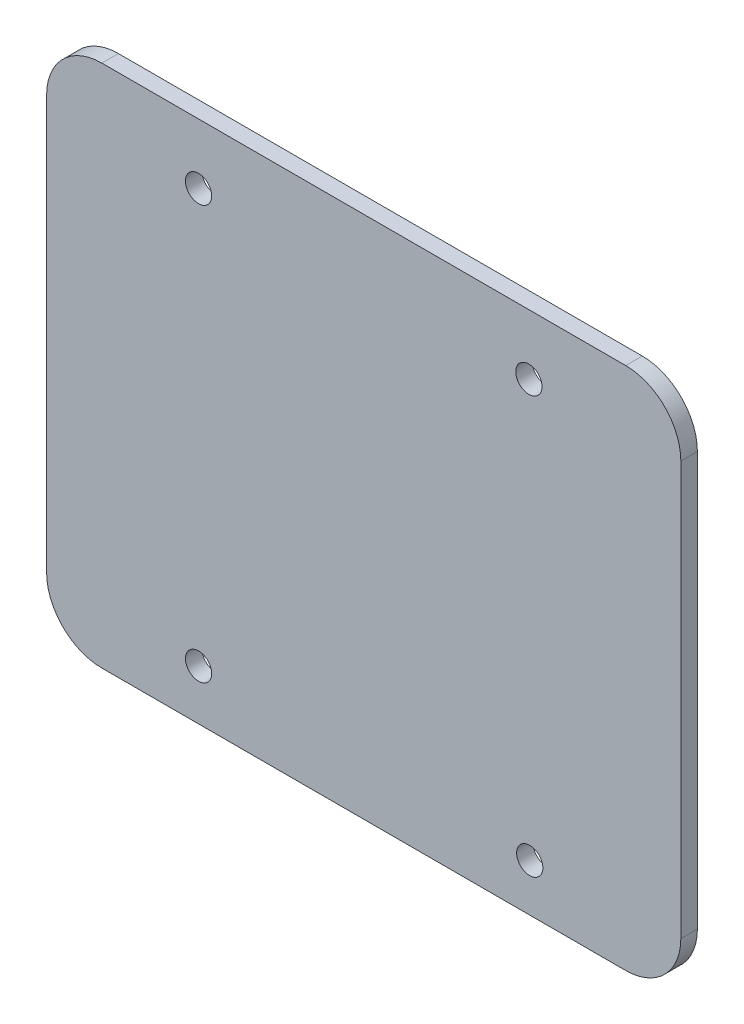
ISO-10303-21;
HEADER;
FILE_DESCRIPTION(('STEP AP214'),'2;1');
FILE_NAME('part.step','',(''),(''),'','','');
FILE_SCHEMA(('AUTOMOTIVE_DESIGN { 1 0 10303 214 1 1 1 1 }'));
ENDSEC;
DATA;
#1=APPLICATION_CONTEXT('core data for automotive mechanical design processes');
#2=APPLICATION_PROTOCOL_DEFINITION('international standard','automotive_design',2000,#1);
#3=PRODUCT_CONTEXT('',#1,'mechanical');
#4=PRODUCT('Part','Part','',(#3));
#5=PRODUCT_RELATED_PRODUCT_CATEGORY('part','',(#4));
#6=PRODUCT_DEFINITION_FORMATION('','',#4);
#7=PRODUCT_DEFINITION_CONTEXT('part definition',#1,'design');
#8=PRODUCT_DEFINITION('design','',#6,#7);
#9=PRODUCT_DEFINITION_SHAPE('','',#8);
#10=(LENGTH_UNIT() NAMED_UNIT(*) SI_UNIT(.MILLI.,.METRE.));
#11=(NAMED_UNIT(*) PLANE_ANGLE_UNIT() SI_UNIT($,.RADIAN.));
#12=(NAMED_UNIT(*) SI_UNIT($,.STERADIAN.) SOLID_ANGLE_UNIT());
#13=UNCERTAINTY_MEASURE_WITH_UNIT(LENGTH_MEASURE(1.E-05),#10,'distance_accuracy_value','');
#14=(GEOMETRIC_REPRESENTATION_CONTEXT(3) GLOBAL_UNCERTAINTY_ASSIGNED_CONTEXT((#13)) GLOBAL_UNIT_ASSIGNED_CONTEXT((#10,
#11,#12)) REPRESENTATION_CONTEXT('',''));
#15=CARTESIAN_POINT('',(0.,0.,0.));
#16=DIRECTION('',(0.,0.,1.));
#17=DIRECTION('',(1.,0.,0.));
#18=AXIS2_PLACEMENT_3D('',#15,#16,#17);
#19=CARTESIAN_POINT('',(10.,10.,3.));
#20=DIRECTION('',(0.,0.,-1.));
#21=DIRECTION('',(-1.,0.,0.));
#22=AXIS2_PLACEMENT_3D('',#19,#20,#21);
#23=PLANE('',#22);
#24=CARTESIAN_POINT('',(10.,10.,3.));
#25=DIRECTION('',(0.,0.,1.));
#26=DIRECTION('',(-1.,0.,0.));
#27=AXIS2_PLACEMENT_3D('',#24,#25,#26);
#28=CIRCLE('',#27,10.);
#29=CARTESIAN_POINT('',(0.,10.0000000000001,3.));
#30=VERTEX_POINT('',#29);
#31=CARTESIAN_POINT('',(10.0000000000001,0.,3.));
#32=VERTEX_POINT('',#31);
#33=EDGE_CURVE('E146',#30,#32,#28,.T.);
#34=ORIENTED_EDGE('',*,*,#33,.T.);
#35=DIRECTION('',(1.,0.,0.));
#36=VECTOR('',#35,1.);
#37=CARTESIAN_POINT('',(10.0000000000001,0.,3.));
#38=LINE('',#37,#36);
#39=CARTESIAN_POINT('',(105.,0.,3.));
#40=VERTEX_POINT('',#39);
#41=EDGE_CURVE('E94',#32,#40,#38,.T.);
#42=ORIENTED_EDGE('',*,*,#41,.T.);
#43=CARTESIAN_POINT('',(105.,10.,3.));
#44=DIRECTION('',(0.,0.,1.));
#45=DIRECTION('',(1.,0.,0.));
#46=AXIS2_PLACEMENT_3D('',#43,#44,#45);
#47=CIRCLE('',#46,10.);
#48=CARTESIAN_POINT('',(115.,10.,3.));
#49=VERTEX_POINT('',#48);
#50=EDGE_CURVE('E161',#40,#49,#47,.T.);
#51=ORIENTED_EDGE('',*,*,#50,.T.);
#52=DIRECTION('',(0.,1.,0.));
#53=VECTOR('',#52,1.);
#54=CARTESIAN_POINT('',(115.,10.0000000000001,3.));
#55=LINE('',#54,#53);
#56=CARTESIAN_POINT('',(115.,84.9999999999999,3.));
#57=VERTEX_POINT('',#56);
#58=EDGE_CURVE('E174',#49,#57,#55,.T.);
#59=ORIENTED_EDGE('',*,*,#58,.T.);
#60=CARTESIAN_POINT('',(105.,85.,3.));
#61=DIRECTION('',(0.,0.,1.));
#62=DIRECTION('',(-1.,0.,0.));
#63=AXIS2_PLACEMENT_3D('',#60,#61,#62);
#64=CIRCLE('',#63,9.99999999999999);
#65=CARTESIAN_POINT('',(105.,95.,3.));
#66=VERTEX_POINT('',#65);
#67=EDGE_CURVE('E113',#57,#66,#64,.T.);
#68=ORIENTED_EDGE('',*,*,#67,.T.);
#69=DIRECTION('',(-1.,0.,0.));
#70=VECTOR('',#69,1.);
#71=CARTESIAN_POINT('',(10.0000000000001,95.,3.));
#72=LINE('',#71,#70);
#73=CARTESIAN_POINT('',(10.0000000000001,95.,3.));
#74=VERTEX_POINT('',#73);
#75=EDGE_CURVE('E107',#66,#74,#72,.T.);
#76=ORIENTED_EDGE('',*,*,#75,.T.);
#77=CARTESIAN_POINT('',(10.,85.,3.));
#78=DIRECTION('',(0.,0.,1.));
#79=DIRECTION('',(-1.,0.,0.));
#80=AXIS2_PLACEMENT_3D('',#77,#78,#79);
#81=CIRCLE('',#80,10.);
#82=CARTESIAN_POINT('',(0.,84.9999999999999,3.));
#83=VERTEX_POINT('',#82);
#84=EDGE_CURVE('E111',#74,#83,#81,.T.);
#85=ORIENTED_EDGE('',*,*,#84,.T.);
#86=DIRECTION('',(0.,-1.,0.));
#87=VECTOR('',#86,1.);
#88=CARTESIAN_POINT('',(0.,10.0000000000001,3.));
#89=LINE('',#88,#87);
#90=EDGE_CURVE('E51',#83,#30,#89,.T.);
#91=ORIENTED_EDGE('',*,*,#90,.T.);
#92=EDGE_LOOP('',(#34,#42,#51,#59,#68,#76,#85,#91));
#93=FACE_BOUND('',#92,.T.);
#94=CARTESIAN_POINT('',(27.55,84.08,3.));
#95=DIRECTION('',(0.,0.,1.));
#96=DIRECTION('',(1.,0.,0.));
#97=AXIS2_PLACEMENT_3D('',#94,#95,#96);
#98=CIRCLE('',#97,2.38125);
#99=CARTESIAN_POINT('',(29.93125,84.08,3.));
#100=VERTEX_POINT('',#99);
#101=EDGE_CURVE('E135',#100,#100,#98,.T.);
#102=ORIENTED_EDGE('',*,*,#101,.F.);
#103=EDGE_LOOP('',(#102));
#104=FACE_BOUND('',#103,.T.);
#105=CARTESIAN_POINT('',(87.45,84.08,3.));
#106=DIRECTION('',(0.,0.,1.));
#107=DIRECTION('',(1.,0.,0.));
#108=AXIS2_PLACEMENT_3D('',#105,#106,#107);
#109=CIRCLE('',#108,2.38125);
#110=CARTESIAN_POINT('',(89.83125,84.08,3.));
#111=VERTEX_POINT('',#110);
#112=EDGE_CURVE('E183',#111,#111,#109,.T.);
#113=ORIENTED_EDGE('',*,*,#112,.F.);
#114=EDGE_LOOP('',(#113));
#115=FACE_BOUND('',#114,.T.);
#116=CARTESIAN_POINT('',(27.55,9.08000000000001,3.));
#117=DIRECTION('',(0.,0.,1.));
#118=DIRECTION('',(1.,0.,0.));
#119=AXIS2_PLACEMENT_3D('',#116,#117,#118);
#120=CIRCLE('',#119,2.38125);
#121=CARTESIAN_POINT('',(29.93125,9.08000000000001,3.));
#122=VERTEX_POINT('',#121);
#123=EDGE_CURVE('E189',#122,#122,#120,.T.);
#124=ORIENTED_EDGE('',*,*,#123,.F.);
#125=EDGE_LOOP('',(#124));
#126=FACE_BOUND('',#125,.T.);
#127=CARTESIAN_POINT('',(87.6,8.58014900676957,3.));
#128=DIRECTION('',(0.,0.,1.));
#129=DIRECTION('',(1.,0.,0.));
#130=AXIS2_PLACEMENT_3D('',#127,#128,#129);
#131=CIRCLE('',#130,2.38125000000001);
#132=CARTESIAN_POINT('',(89.98125,8.58014900676957,3.));
#133=VERTEX_POINT('',#132);
#134=EDGE_CURVE('E195',#133,#133,#131,.T.);
#135=ORIENTED_EDGE('',*,*,#134,.F.);
#136=EDGE_LOOP('',(#135));
#137=FACE_BOUND('',#136,.T.);
#138=ADVANCED_FACE('F34',(#93,#104,#115,#126,#137),#23,.F.);
#139=CARTESIAN_POINT('',(10.,10.,0.));
#140=DIRECTION('',(0.,0.,-1.));
#141=DIRECTION('',(-1.,0.,0.));
#142=AXIS2_PLACEMENT_3D('',#139,#140,#141);
#143=PLANE('',#142);
#144=CARTESIAN_POINT('',(27.55,9.08000000000001,0.));
#145=DIRECTION('',(0.,0.,1.));
#146=DIRECTION('',(1.,0.,0.));
#147=AXIS2_PLACEMENT_3D('',#144,#145,#146);
#148=CIRCLE('',#147,2.38125);
#149=CARTESIAN_POINT('',(29.93125,9.08000000000001,0.));
#150=VERTEX_POINT('',#149);
#151=EDGE_CURVE('E192',#150,#150,#148,.T.);
#152=ORIENTED_EDGE('',*,*,#151,.T.);
#153=EDGE_LOOP('',(#152));
#154=FACE_BOUND('',#153,.T.);
#155=CARTESIAN_POINT('',(27.55,84.08,0.));
#156=DIRECTION('',(0.,0.,1.));
#157=DIRECTION('',(1.,0.,0.));
#158=AXIS2_PLACEMENT_3D('',#155,#156,#157);
#159=CIRCLE('',#158,2.38125);
#160=CARTESIAN_POINT('',(29.93125,84.08,0.));
#161=VERTEX_POINT('',#160);
#162=EDGE_CURVE('E180',#161,#161,#159,.T.);
#163=ORIENTED_EDGE('',*,*,#162,.T.);
#164=EDGE_LOOP('',(#163));
#165=FACE_BOUND('',#164,.T.);
#166=CARTESIAN_POINT('',(10.,10.,0.));
#167=DIRECTION('',(0.,0.,1.));
#168=DIRECTION('',(-1.,0.,0.));
#169=AXIS2_PLACEMENT_3D('',#166,#167,#168);
#170=CIRCLE('',#169,10.);
#171=CARTESIAN_POINT('',(0.,10.0000000000001,0.));
#172=VERTEX_POINT('',#171);
#173=CARTESIAN_POINT('',(10.0000000000001,0.,0.));
#174=VERTEX_POINT('',#173);
#175=EDGE_CURVE('E131',#172,#174,#170,.T.);
#176=ORIENTED_EDGE('',*,*,#175,.F.);
#177=DIRECTION('',(0.,-1.,0.));
#178=VECTOR('',#177,1.);
#179=CARTESIAN_POINT('',(0.,10.0000000000001,0.));
#180=LINE('',#179,#178);
#181=CARTESIAN_POINT('',(0.,84.9999999999999,0.));
#182=VERTEX_POINT('',#181);
#183=EDGE_CURVE('E86',#182,#172,#180,.T.);
#184=ORIENTED_EDGE('',*,*,#183,.F.);
#185=CARTESIAN_POINT('',(10.,85.,0.));
#186=DIRECTION('',(0.,0.,1.));
#187=DIRECTION('',(-1.,0.,0.));
#188=AXIS2_PLACEMENT_3D('',#185,#186,#187);
#189=CIRCLE('',#188,10.);
#190=CARTESIAN_POINT('',(10.0000000000001,95.,0.));
#191=VERTEX_POINT('',#190);
#192=EDGE_CURVE('E80',#191,#182,#189,.T.);
#193=ORIENTED_EDGE('',*,*,#192,.F.);
#194=DIRECTION('',(-1.,0.,0.));
#195=VECTOR('',#194,1.);
#196=CARTESIAN_POINT('',(10.0000000000001,95.,0.));
#197=LINE('',#196,#195);
#198=CARTESIAN_POINT('',(105.,95.,0.));
#199=VERTEX_POINT('',#198);
#200=EDGE_CURVE('E121',#199,#191,#197,.T.);
#201=ORIENTED_EDGE('',*,*,#200,.F.);
#202=CARTESIAN_POINT('',(105.,85.,0.));
#203=DIRECTION('',(0.,0.,1.));
#204=DIRECTION('',(-1.,0.,0.));
#205=AXIS2_PLACEMENT_3D('',#202,#203,#204);
#206=CIRCLE('',#205,9.99999999999999);
#207=CARTESIAN_POINT('',(115.,84.9999999999999,0.));
#208=VERTEX_POINT('',#207);
#209=EDGE_CURVE('E141',#208,#199,#206,.T.);
#210=ORIENTED_EDGE('',*,*,#209,.F.);
#211=DIRECTION('',(0.,1.,0.));
#212=VECTOR('',#211,1.);
#213=CARTESIAN_POINT('',(115.,10.0000000000001,0.));
#214=LINE('',#213,#212);
#215=CARTESIAN_POINT('',(115.,10.,0.));
#216=VERTEX_POINT('',#215);
#217=EDGE_CURVE('E139',#216,#208,#214,.T.);
#218=ORIENTED_EDGE('',*,*,#217,.F.);
#219=CARTESIAN_POINT('',(105.,10.,0.));
#220=DIRECTION('',(0.,0.,1.));
#221=DIRECTION('',(1.,0.,0.));
#222=AXIS2_PLACEMENT_3D('',#219,#220,#221);
#223=CIRCLE('',#222,10.);
#224=CARTESIAN_POINT('',(105.,0.,0.));
#225=VERTEX_POINT('',#224);
#226=EDGE_CURVE('E137',#225,#216,#223,.T.);
#227=ORIENTED_EDGE('',*,*,#226,.F.);
#228=DIRECTION('',(1.,0.,0.));
#229=VECTOR('',#228,1.);
#230=CARTESIAN_POINT('',(10.0000000000001,0.,0.));
#231=LINE('',#230,#229);
#232=EDGE_CURVE('E134',#174,#225,#231,.T.);
#233=ORIENTED_EDGE('',*,*,#232,.F.);
#234=EDGE_LOOP('',(#176,#184,#193,#201,#210,#218,#227,#233));
#235=FACE_BOUND('',#234,.T.);
#236=CARTESIAN_POINT('',(87.45,84.08,0.));
#237=DIRECTION('',(0.,0.,1.));
#238=DIRECTION('',(1.,0.,0.));
#239=AXIS2_PLACEMENT_3D('',#236,#237,#238);
#240=CIRCLE('',#239,2.38125);
#241=CARTESIAN_POINT('',(89.83125,84.08,0.));
#242=VERTEX_POINT('',#241);
#243=EDGE_CURVE('E186',#242,#242,#240,.T.);
#244=ORIENTED_EDGE('',*,*,#243,.T.);
#245=EDGE_LOOP('',(#244));
#246=FACE_BOUND('',#245,.T.);
#247=CARTESIAN_POINT('',(87.6,8.58014900676957,0.));
#248=DIRECTION('',(0.,0.,1.));
#249=DIRECTION('',(1.,0.,0.));
#250=AXIS2_PLACEMENT_3D('',#247,#248,#249);
#251=CIRCLE('',#250,2.38125000000001);
#252=CARTESIAN_POINT('',(89.98125,8.58014900676957,0.));
#253=VERTEX_POINT('',#252);
#254=EDGE_CURVE('E198',#253,#253,#251,.T.);
#255=ORIENTED_EDGE('',*,*,#254,.T.);
#256=EDGE_LOOP('',(#255));
#257=FACE_BOUND('',#256,.T.);
#258=ADVANCED_FACE('F165',(#154,#165,#235,#246,#257),#143,.T.);
#259=CARTESIAN_POINT('',(10.,10.,3.));
#260=DIRECTION('',(0.,0.,-1.));
#261=DIRECTION('',(-1.,0.,0.));
#262=AXIS2_PLACEMENT_3D('',#259,#260,#261);
#263=CYLINDRICAL_SURFACE('',#262,10.);
#264=ORIENTED_EDGE('',*,*,#175,.T.);
#265=DIRECTION('',(0.,0.,-1.));
#266=VECTOR('',#265,1.);
#267=CARTESIAN_POINT('',(10.0000000000001,0.,3.));
#268=LINE('',#267,#266);
#269=EDGE_CURVE('E11',#32,#174,#268,.T.);
#270=ORIENTED_EDGE('',*,*,#269,.F.);
#271=ORIENTED_EDGE('',*,*,#33,.F.);
#272=DIRECTION('',(0.,0.,-1.));
#273=VECTOR('',#272,1.);
#274=CARTESIAN_POINT('',(0.,10.0000000000001,3.));
#275=LINE('',#274,#273);
#276=EDGE_CURVE('E127',#30,#172,#275,.T.);
#277=ORIENTED_EDGE('',*,*,#276,.T.);
#278=EDGE_LOOP('',(#264,#270,#271,#277));
#279=FACE_BOUND('',#278,.T.);
#280=ADVANCED_FACE('F36',(#279),#263,.T.);
#281=CARTESIAN_POINT('',(10.0000000000001,0.,3.));
#282=DIRECTION('',(0.,1.,0.));
#283=DIRECTION('',(0.,0.,1.));
#284=AXIS2_PLACEMENT_3D('',#281,#282,#283);
#285=PLANE('',#284);
#286=ORIENTED_EDGE('',*,*,#232,.T.);
#287=DIRECTION('',(0.,0.,-1.));
#288=VECTOR('',#287,1.);
#289=CARTESIAN_POINT('',(105.,0.,3.));
#290=LINE('',#289,#288);
#291=EDGE_CURVE('E43',#40,#225,#290,.T.);
#292=ORIENTED_EDGE('',*,*,#291,.F.);
#293=ORIENTED_EDGE('',*,*,#41,.F.);
#294=ORIENTED_EDGE('',*,*,#269,.T.);
#295=EDGE_LOOP('',(#286,#292,#293,#294));
#296=FACE_BOUND('',#295,.T.);
#297=ADVANCED_FACE('F230',(#296),#285,.F.);
#298=CARTESIAN_POINT('',(105.,10.,3.));
#299=DIRECTION('',(0.,0.,-1.));
#300=DIRECTION('',(-1.,0.,0.));
#301=AXIS2_PLACEMENT_3D('',#298,#299,#300);
#302=CYLINDRICAL_SURFACE('',#301,10.);
#303=ORIENTED_EDGE('',*,*,#226,.T.);
#304=DIRECTION('',(0.,0.,-1.));
#305=VECTOR('',#304,1.);
#306=CARTESIAN_POINT('',(115.,10.,3.));
#307=LINE('',#306,#305);
#308=EDGE_CURVE('E153',#49,#216,#307,.T.);
#309=ORIENTED_EDGE('',*,*,#308,.F.);
#310=ORIENTED_EDGE('',*,*,#50,.F.);
#311=ORIENTED_EDGE('',*,*,#291,.T.);
#312=EDGE_LOOP('',(#303,#309,#310,#311));
#313=FACE_BOUND('',#312,.T.);
#314=ADVANCED_FACE('F159',(#313),#302,.T.);
#315=CARTESIAN_POINT('',(115.,10.0000000000001,3.));
#316=DIRECTION('',(-1.,0.,0.));
#317=DIRECTION('',(0.,-1.,0.));
#318=AXIS2_PLACEMENT_3D('',#315,#316,#317);
#319=PLANE('',#318);
#320=ORIENTED_EDGE('',*,*,#217,.T.);
#321=DIRECTION('',(0.,0.,-1.));
#322=VECTOR('',#321,1.);
#323=CARTESIAN_POINT('',(115.,84.9999999999999,3.));
#324=LINE('',#323,#322);
#325=EDGE_CURVE('E150',#57,#208,#324,.T.);
#326=ORIENTED_EDGE('',*,*,#325,.F.);
#327=ORIENTED_EDGE('',*,*,#58,.F.);
#328=ORIENTED_EDGE('',*,*,#308,.T.);
#329=EDGE_LOOP('',(#320,#326,#327,#328));
#330=FACE_BOUND('',#329,.T.);
#331=ADVANCED_FACE('F170',(#330),#319,.F.);
#332=CARTESIAN_POINT('',(105.,85.,3.));
#333=DIRECTION('',(0.,0.,-1.));
#334=DIRECTION('',(-1.,0.,0.));
#335=AXIS2_PLACEMENT_3D('',#332,#333,#334);
#336=CYLINDRICAL_SURFACE('',#335,9.99999999999999);
#337=ORIENTED_EDGE('',*,*,#209,.T.);
#338=DIRECTION('',(0.,0.,-1.));
#339=VECTOR('',#338,1.);
#340=CARTESIAN_POINT('',(105.,95.,3.));
#341=LINE('',#340,#339);
#342=EDGE_CURVE('E122',#66,#199,#341,.T.);
#343=ORIENTED_EDGE('',*,*,#342,.F.);
#344=ORIENTED_EDGE('',*,*,#67,.F.);
#345=ORIENTED_EDGE('',*,*,#325,.T.);
#346=EDGE_LOOP('',(#337,#343,#344,#345));
#347=FACE_BOUND('',#346,.T.);
#348=ADVANCED_FACE('F173',(#347),#336,.T.);
#349=CARTESIAN_POINT('',(10.0000000000001,95.,3.));
#350=DIRECTION('',(0.,-1.,0.));
#351=DIRECTION('',(0.,0.,-1.));
#352=AXIS2_PLACEMENT_3D('',#349,#350,#351);
#353=PLANE('',#352);
#354=ORIENTED_EDGE('',*,*,#200,.T.);
#355=DIRECTION('',(0.,0.,-1.));
#356=VECTOR('',#355,1.);
#357=CARTESIAN_POINT('',(10.0000000000001,95.,3.));
#358=LINE('',#357,#356);
#359=EDGE_CURVE('E118',#74,#191,#358,.T.);
#360=ORIENTED_EDGE('',*,*,#359,.F.);
#361=ORIENTED_EDGE('',*,*,#75,.F.);
#362=ORIENTED_EDGE('',*,*,#342,.T.);
#363=EDGE_LOOP('',(#354,#360,#361,#362));
#364=FACE_BOUND('',#363,.T.);
#365=ADVANCED_FACE('F119',(#364),#353,.F.);
#366=CARTESIAN_POINT('',(10.,85.,3.));
#367=DIRECTION('',(0.,0.,-1.));
#368=DIRECTION('',(-1.,0.,0.));
#369=AXIS2_PLACEMENT_3D('',#366,#367,#368);
#370=CYLINDRICAL_SURFACE('',#369,10.);
#371=ORIENTED_EDGE('',*,*,#192,.T.);
#372=DIRECTION('',(0.,0.,-1.));
#373=VECTOR('',#372,1.);
#374=CARTESIAN_POINT('',(0.,84.9999999999999,3.));
#375=LINE('',#374,#373);
#376=EDGE_CURVE('E123',#83,#182,#375,.T.);
#377=ORIENTED_EDGE('',*,*,#376,.F.);
#378=ORIENTED_EDGE('',*,*,#84,.F.);
#379=ORIENTED_EDGE('',*,*,#359,.T.);
#380=EDGE_LOOP('',(#371,#377,#378,#379));
#381=FACE_BOUND('',#380,.T.);
#382=ADVANCED_FACE('F125',(#381),#370,.T.);
#383=CARTESIAN_POINT('',(0.,10.0000000000001,3.));
#384=DIRECTION('',(1.,0.,0.));
#385=DIRECTION('',(0.,0.,-1.));
#386=AXIS2_PLACEMENT_3D('',#383,#384,#385);
#387=PLANE('',#386);
#388=ORIENTED_EDGE('',*,*,#183,.T.);
#389=ORIENTED_EDGE('',*,*,#276,.F.);
#390=ORIENTED_EDGE('',*,*,#90,.F.);
#391=ORIENTED_EDGE('',*,*,#376,.T.);
#392=EDGE_LOOP('',(#388,#389,#390,#391));
#393=FACE_BOUND('',#392,.T.);
#394=ADVANCED_FACE('F218',(#393),#387,.F.);
#395=CARTESIAN_POINT('',(27.55,84.08,3.));
#396=DIRECTION('',(0.,0.,-1.));
#397=DIRECTION('',(-1.,0.,0.));
#398=AXIS2_PLACEMENT_3D('',#395,#396,#397);
#399=CYLINDRICAL_SURFACE('',#398,2.38125);
#400=ORIENTED_EDGE('',*,*,#101,.T.);
#401=EDGE_LOOP('',(#400));
#402=FACE_BOUND('',#401,.T.);
#403=ORIENTED_EDGE('',*,*,#162,.F.);
#404=EDGE_LOOP('',(#403));
#405=FACE_BOUND('',#404,.T.);
#406=ADVANCED_FACE('F215',(#402,#405),#399,.F.);
#407=CARTESIAN_POINT('',(87.45,84.08,3.));
#408=DIRECTION('',(0.,0.,-1.));
#409=DIRECTION('',(-1.,0.,0.));
#410=AXIS2_PLACEMENT_3D('',#407,#408,#409);
#411=CYLINDRICAL_SURFACE('',#410,2.38125);
#412=ORIENTED_EDGE('',*,*,#112,.T.);
#413=EDGE_LOOP('',(#412));
#414=FACE_BOUND('',#413,.T.);
#415=ORIENTED_EDGE('',*,*,#243,.F.);
#416=EDGE_LOOP('',(#415));
#417=FACE_BOUND('',#416,.T.);
#418=ADVANCED_FACE('F294',(#414,#417),#411,.F.);
#419=CARTESIAN_POINT('',(27.55,9.08000000000001,3.));
#420=DIRECTION('',(0.,0.,-1.));
#421=DIRECTION('',(-1.,0.,0.));
#422=AXIS2_PLACEMENT_3D('',#419,#420,#421);
#423=CYLINDRICAL_SURFACE('',#422,2.38125);
#424=ORIENTED_EDGE('',*,*,#123,.T.);
#425=EDGE_LOOP('',(#424));
#426=FACE_BOUND('',#425,.T.);
#427=ORIENTED_EDGE('',*,*,#151,.F.);
#428=EDGE_LOOP('',(#427));
#429=FACE_BOUND('',#428,.T.);
#430=ADVANCED_FACE('F302',(#426,#429),#423,.F.);
#431=CARTESIAN_POINT('',(87.6,8.58014900676957,3.));
#432=DIRECTION('',(0.,0.,-1.));
#433=DIRECTION('',(-1.,0.,0.));
#434=AXIS2_PLACEMENT_3D('',#431,#432,#433);
#435=CYLINDRICAL_SURFACE('',#434,2.38125000000001);
#436=ORIENTED_EDGE('',*,*,#134,.T.);
#437=EDGE_LOOP('',(#436));
#438=FACE_BOUND('',#437,.T.);
#439=ORIENTED_EDGE('',*,*,#254,.F.);
#440=EDGE_LOOP('',(#439));
#441=FACE_BOUND('',#440,.T.);
#442=ADVANCED_FACE('F204',(#438,#441),#435,.F.);
#443=CLOSED_SHELL('',(#138,#258,#280,#297,#314,#331,#348,#365,#382,#394,#406,#418,#430,#442));
#444=MANIFOLD_SOLID_BREP('B2',#443);
#445=ADVANCED_BREP_SHAPE_REPRESENTATION('',(#18,#444),#14);
#446=SHAPE_DEFINITION_REPRESENTATION(#9,#445);
ENDSEC;
END-ISO-10303-21;
